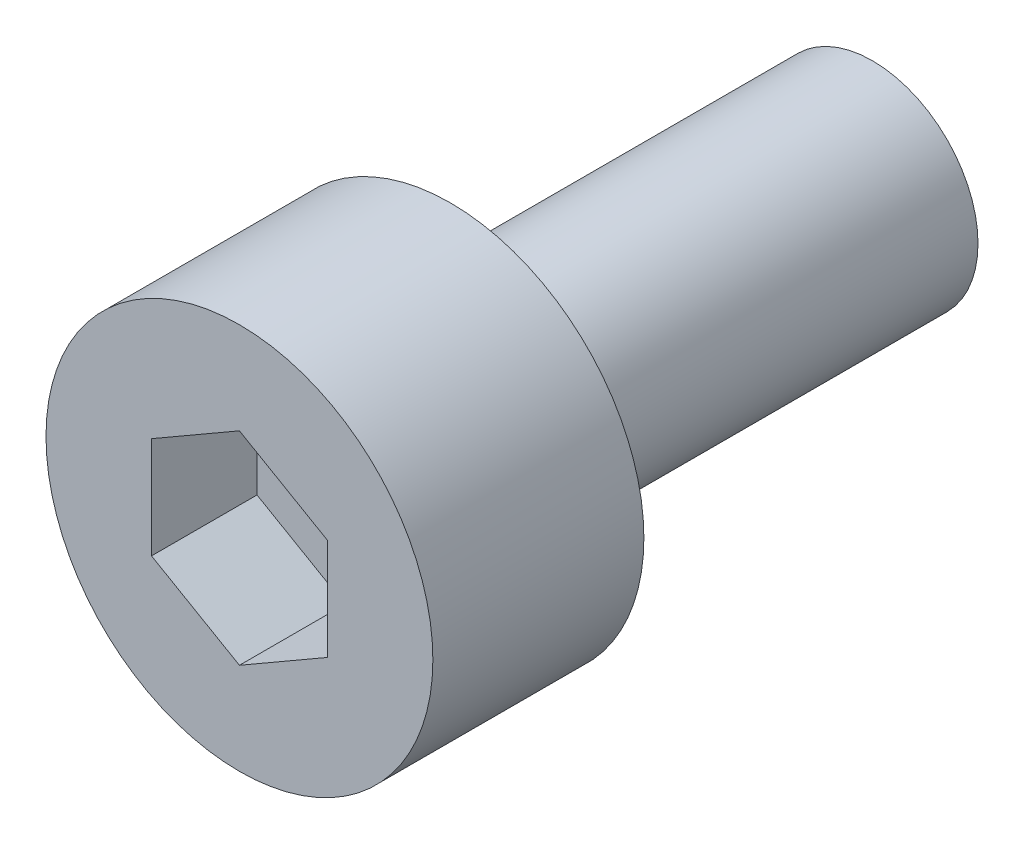
ISO-10303-21;
HEADER;
FILE_DESCRIPTION(('STEP AP214'),'2;1');
FILE_NAME('part.step','',(''),(''),'','','');
FILE_SCHEMA(('AUTOMOTIVE_DESIGN { 1 0 10303 214 1 1 1 1 }'));
ENDSEC;
DATA;
#1=APPLICATION_CONTEXT('core data for automotive mechanical design processes');
#2=APPLICATION_PROTOCOL_DEFINITION('international standard','automotive_design',2000,#1);
#3=PRODUCT_CONTEXT('',#1,'mechanical');
#4=PRODUCT('Part','Part','',(#3));
#5=PRODUCT_RELATED_PRODUCT_CATEGORY('part','',(#4));
#6=PRODUCT_DEFINITION_FORMATION('','',#4);
#7=PRODUCT_DEFINITION_CONTEXT('part definition',#1,'design');
#8=PRODUCT_DEFINITION('design','',#6,#7);
#9=PRODUCT_DEFINITION_SHAPE('','',#8);
#10=(LENGTH_UNIT() NAMED_UNIT(*) SI_UNIT(.MILLI.,.METRE.));
#11=(NAMED_UNIT(*) PLANE_ANGLE_UNIT() SI_UNIT($,.RADIAN.));
#12=(NAMED_UNIT(*) SI_UNIT($,.STERADIAN.) SOLID_ANGLE_UNIT());
#13=UNCERTAINTY_MEASURE_WITH_UNIT(LENGTH_MEASURE(1.E-05),#10,'distance_accuracy_value','');
#14=(GEOMETRIC_REPRESENTATION_CONTEXT(3) GLOBAL_UNCERTAINTY_ASSIGNED_CONTEXT((#13)) GLOBAL_UNIT_ASSIGNED_CONTEXT((#10,
#11,#12)) REPRESENTATION_CONTEXT('',''));
#15=CARTESIAN_POINT('',(0.,0.,0.));
#16=DIRECTION('',(0.,0.,1.));
#17=DIRECTION('',(1.,0.,0.));
#18=AXIS2_PLACEMENT_3D('',#15,#16,#17);
#19=CARTESIAN_POINT('',(0.,0.,3.));
#20=DIRECTION('',(0.,0.,-1.));
#21=DIRECTION('',(-1.,0.,0.));
#22=AXIS2_PLACEMENT_3D('',#19,#20,#21);
#23=CYLINDRICAL_SURFACE('',#22,2.75);
#24=CARTESIAN_POINT('',(0.,0.,3.));
#25=DIRECTION('',(0.,0.,1.));
#26=DIRECTION('',(1.,0.,0.));
#27=AXIS2_PLACEMENT_3D('',#24,#25,#26);
#28=CIRCLE('',#27,2.75);
#29=CARTESIAN_POINT('',(2.75,0.,3.));
#30=VERTEX_POINT('',#29);
#31=EDGE_CURVE('E52',#30,#30,#28,.T.);
#32=ORIENTED_EDGE('',*,*,#31,.F.);
#33=EDGE_LOOP('',(#32));
#34=FACE_BOUND('',#33,.T.);
#35=CARTESIAN_POINT('',(0.,0.,0.));
#36=DIRECTION('',(0.,0.,1.));
#37=DIRECTION('',(1.,0.,0.));
#38=AXIS2_PLACEMENT_3D('',#35,#36,#37);
#39=CIRCLE('',#38,2.75);
#40=CARTESIAN_POINT('',(2.75,0.,0.));
#41=VERTEX_POINT('',#40);
#42=EDGE_CURVE('E46',#41,#41,#39,.T.);
#43=ORIENTED_EDGE('',*,*,#42,.T.);
#44=EDGE_LOOP('',(#43));
#45=FACE_BOUND('',#44,.T.);
#46=ADVANCED_FACE('F43',(#34,#45),#23,.T.);
#47=CARTESIAN_POINT('',(0.,0.,3.));
#48=DIRECTION('',(0.,0.,1.));
#49=DIRECTION('',(1.,0.,0.));
#50=AXIS2_PLACEMENT_3D('',#47,#48,#49);
#51=PLANE('',#50);
#52=DIRECTION('',(0.866025403784439,-0.5,0.));
#53=VECTOR('',#52,1.);
#54=CARTESIAN_POINT('',(-1.25,-0.721687836487032,3.));
#55=LINE('',#54,#53);
#56=CARTESIAN_POINT('',(-1.25,-0.721687836487032,3.));
#57=VERTEX_POINT('',#56);
#58=CARTESIAN_POINT('',(0.,-1.44337567297406,3.));
#59=VERTEX_POINT('',#58);
#60=EDGE_CURVE('E60',#57,#59,#55,.T.);
#61=ORIENTED_EDGE('',*,*,#60,.F.);
#62=DIRECTION('',(0.,-1.,0.));
#63=VECTOR('',#62,1.);
#64=CARTESIAN_POINT('',(-1.25,0.721687836487032,3.));
#65=LINE('',#64,#63);
#66=CARTESIAN_POINT('',(-1.25,0.721687836487032,3.));
#67=VERTEX_POINT('',#66);
#68=EDGE_CURVE('E154',#67,#57,#65,.T.);
#69=ORIENTED_EDGE('',*,*,#68,.F.);
#70=DIRECTION('',(-0.866025403784438,-0.5,0.));
#71=VECTOR('',#70,1.);
#72=CARTESIAN_POINT('',(0.,1.44337567297407,3.));
#73=LINE('',#72,#71);
#74=CARTESIAN_POINT('',(0.,1.44337567297407,3.));
#75=VERTEX_POINT('',#74);
#76=EDGE_CURVE('E151',#75,#67,#73,.T.);
#77=ORIENTED_EDGE('',*,*,#76,.F.);
#78=DIRECTION('',(-0.866025403784439,0.5,0.));
#79=VECTOR('',#78,1.);
#80=CARTESIAN_POINT('',(1.25,0.721687836487033,3.));
#81=LINE('',#80,#79);
#82=CARTESIAN_POINT('',(1.25,0.721687836487033,3.));
#83=VERTEX_POINT('',#82);
#84=EDGE_CURVE('E108',#83,#75,#81,.T.);
#85=ORIENTED_EDGE('',*,*,#84,.F.);
#86=DIRECTION('',(0.,1.,0.));
#87=VECTOR('',#86,1.);
#88=CARTESIAN_POINT('',(1.25,-0.721687836487032,3.));
#89=LINE('',#88,#87);
#90=CARTESIAN_POINT('',(1.25,-0.721687836487032,3.));
#91=VERTEX_POINT('',#90);
#92=EDGE_CURVE('E145',#91,#83,#89,.T.);
#93=ORIENTED_EDGE('',*,*,#92,.F.);
#94=DIRECTION('',(0.866025403784439,0.5,0.));
#95=VECTOR('',#94,1.);
#96=CARTESIAN_POINT('',(0.,-1.44337567297406,3.));
#97=LINE('',#96,#95);
#98=EDGE_CURVE('E140',#59,#91,#97,.T.);
#99=ORIENTED_EDGE('',*,*,#98,.F.);
#100=EDGE_LOOP('',(#61,#69,#77,#85,#93,#99));
#101=FACE_BOUND('',#100,.T.);
#102=ORIENTED_EDGE('',*,*,#31,.T.);
#103=EDGE_LOOP('',(#102));
#104=FACE_BOUND('',#103,.T.);
#105=ADVANCED_FACE('F180',(#101,#104),#51,.T.);
#106=CARTESIAN_POINT('',(0.,0.,0.));
#107=DIRECTION('',(0.,0.,1.));
#108=DIRECTION('',(1.,0.,0.));
#109=AXIS2_PLACEMENT_3D('',#106,#107,#108);
#110=PLANE('',#109);
#111=CARTESIAN_POINT('',(0.,0.,0.));
#112=DIRECTION('',(0.,0.,-1.));
#113=DIRECTION('',(-1.,0.,0.));
#114=AXIS2_PLACEMENT_3D('',#111,#112,#113);
#115=CIRCLE('',#114,1.5);
#116=CARTESIAN_POINT('',(-1.5,0.,0.));
#117=VERTEX_POINT('',#116);
#118=EDGE_CURVE('E11',#117,#117,#115,.T.);
#119=ORIENTED_EDGE('',*,*,#118,.F.);
#120=EDGE_LOOP('',(#119));
#121=FACE_BOUND('',#120,.T.);
#122=ORIENTED_EDGE('',*,*,#42,.F.);
#123=EDGE_LOOP('',(#122));
#124=FACE_BOUND('',#123,.T.);
#125=ADVANCED_FACE('F177',(#121,#124),#110,.F.);
#126=CARTESIAN_POINT('',(-1.25,-0.721687836487032,1.5));
#127=DIRECTION('',(-0.5,-0.866025403784439,0.));
#128=DIRECTION('',(0.866025403784439,-0.5,0.));
#129=AXIS2_PLACEMENT_3D('',#126,#127,#128);
#130=PLANE('',#129);
#131=ORIENTED_EDGE('',*,*,#60,.T.);
#132=DIRECTION('',(0.,0.,1.));
#133=VECTOR('',#132,1.);
#134=CARTESIAN_POINT('',(0.,-1.44337567297406,1.5));
#135=LINE('',#134,#133);
#136=CARTESIAN_POINT('',(0.,-1.44337567297406,1.5));
#137=VERTEX_POINT('',#136);
#138=EDGE_CURVE('E90',#137,#59,#135,.T.);
#139=ORIENTED_EDGE('',*,*,#138,.F.);
#140=DIRECTION('',(0.866025403784439,-0.5,0.));
#141=VECTOR('',#140,1.);
#142=CARTESIAN_POINT('',(-1.25,-0.721687836487032,1.5));
#143=LINE('',#142,#141);
#144=CARTESIAN_POINT('',(-1.25,-0.721687836487032,1.5));
#145=VERTEX_POINT('',#144);
#146=EDGE_CURVE('E157',#145,#137,#143,.T.);
#147=ORIENTED_EDGE('',*,*,#146,.F.);
#148=DIRECTION('',(0.,0.,1.));
#149=VECTOR('',#148,1.);
#150=CARTESIAN_POINT('',(-1.25,-0.721687836487032,1.5));
#151=LINE('',#150,#149);
#152=EDGE_CURVE('E68',#145,#57,#151,.T.);
#153=ORIENTED_EDGE('',*,*,#152,.T.);
#154=EDGE_LOOP('',(#131,#139,#147,#153));
#155=FACE_BOUND('',#154,.T.);
#156=ADVANCED_FACE('F179',(#155),#130,.F.);
#157=CARTESIAN_POINT('',(-1.25,0.721687836487032,1.5));
#158=DIRECTION('',(-1.,0.,0.));
#159=DIRECTION('',(0.,0.,1.));
#160=AXIS2_PLACEMENT_3D('',#157,#158,#159);
#161=PLANE('',#160);
#162=ORIENTED_EDGE('',*,*,#68,.T.);
#163=ORIENTED_EDGE('',*,*,#152,.F.);
#164=DIRECTION('',(0.,-1.,0.));
#165=VECTOR('',#164,1.);
#166=CARTESIAN_POINT('',(-1.25,0.721687836487032,1.5));
#167=LINE('',#166,#165);
#168=CARTESIAN_POINT('',(-1.25,0.721687836487032,1.5));
#169=VERTEX_POINT('',#168);
#170=EDGE_CURVE('E122',#169,#145,#167,.T.);
#171=ORIENTED_EDGE('',*,*,#170,.F.);
#172=DIRECTION('',(0.,0.,1.));
#173=VECTOR('',#172,1.);
#174=CARTESIAN_POINT('',(-1.25,0.721687836487032,1.5));
#175=LINE('',#174,#173);
#176=EDGE_CURVE('E113',#169,#67,#175,.T.);
#177=ORIENTED_EDGE('',*,*,#176,.T.);
#178=EDGE_LOOP('',(#162,#163,#171,#177));
#179=FACE_BOUND('',#178,.T.);
#180=ADVANCED_FACE('F186',(#179),#161,.F.);
#181=CARTESIAN_POINT('',(0.,1.44337567297407,1.5));
#182=DIRECTION('',(-0.5,0.866025403784439,0.));
#183=DIRECTION('',(-0.866025403784439,-0.5,0.));
#184=AXIS2_PLACEMENT_3D('',#181,#182,#183);
#185=PLANE('',#184);
#186=ORIENTED_EDGE('',*,*,#76,.T.);
#187=ORIENTED_EDGE('',*,*,#176,.F.);
#188=DIRECTION('',(-0.866025403784438,-0.5,0.));
#189=VECTOR('',#188,1.);
#190=CARTESIAN_POINT('',(0.,1.44337567297407,1.5));
#191=LINE('',#190,#189);
#192=CARTESIAN_POINT('',(0.,1.44337567297407,1.5));
#193=VERTEX_POINT('',#192);
#194=EDGE_CURVE('E117',#193,#169,#191,.T.);
#195=ORIENTED_EDGE('',*,*,#194,.F.);
#196=DIRECTION('',(0.,0.,1.));
#197=VECTOR('',#196,1.);
#198=CARTESIAN_POINT('',(0.,1.44337567297407,1.5));
#199=LINE('',#198,#197);
#200=EDGE_CURVE('E101',#193,#75,#199,.T.);
#201=ORIENTED_EDGE('',*,*,#200,.T.);
#202=EDGE_LOOP('',(#186,#187,#195,#201));
#203=FACE_BOUND('',#202,.T.);
#204=ADVANCED_FACE('F118',(#203),#185,.F.);
#205=CARTESIAN_POINT('',(1.25,0.721687836487033,1.5));
#206=DIRECTION('',(0.5,0.866025403784439,0.));
#207=DIRECTION('',(-0.866025403784439,0.5,0.));
#208=AXIS2_PLACEMENT_3D('',#205,#206,#207);
#209=PLANE('',#208);
#210=ORIENTED_EDGE('',*,*,#84,.T.);
#211=ORIENTED_EDGE('',*,*,#200,.F.);
#212=DIRECTION('',(-0.866025403784439,0.5,0.));
#213=VECTOR('',#212,1.);
#214=CARTESIAN_POINT('',(1.25,0.721687836487033,1.5));
#215=LINE('',#214,#213);
#216=CARTESIAN_POINT('',(1.25,0.721687836487033,1.5));
#217=VERTEX_POINT('',#216);
#218=EDGE_CURVE('E105',#217,#193,#215,.T.);
#219=ORIENTED_EDGE('',*,*,#218,.F.);
#220=DIRECTION('',(0.,0.,1.));
#221=VECTOR('',#220,1.);
#222=CARTESIAN_POINT('',(1.25,0.721687836487033,1.5));
#223=LINE('',#222,#221);
#224=EDGE_CURVE('E114',#217,#83,#223,.T.);
#225=ORIENTED_EDGE('',*,*,#224,.T.);
#226=EDGE_LOOP('',(#210,#211,#219,#225));
#227=FACE_BOUND('',#226,.T.);
#228=ADVANCED_FACE('F103',(#227),#209,.F.);
#229=CARTESIAN_POINT('',(1.25,-0.721687836487032,1.5));
#230=DIRECTION('',(1.,0.,0.));
#231=DIRECTION('',(0.,1.,0.));
#232=AXIS2_PLACEMENT_3D('',#229,#230,#231);
#233=PLANE('',#232);
#234=ORIENTED_EDGE('',*,*,#92,.T.);
#235=ORIENTED_EDGE('',*,*,#224,.F.);
#236=DIRECTION('',(0.,1.,0.));
#237=VECTOR('',#236,1.);
#238=CARTESIAN_POINT('',(1.25,-0.721687836487032,1.5));
#239=LINE('',#238,#237);
#240=CARTESIAN_POINT('',(1.25,-0.721687836487032,1.5));
#241=VERTEX_POINT('',#240);
#242=EDGE_CURVE('E128',#241,#217,#239,.T.);
#243=ORIENTED_EDGE('',*,*,#242,.F.);
#244=DIRECTION('',(0.,0.,1.));
#245=VECTOR('',#244,1.);
#246=CARTESIAN_POINT('',(1.25,-0.721687836487032,1.5));
#247=LINE('',#246,#245);
#248=EDGE_CURVE('E164',#241,#91,#247,.T.);
#249=ORIENTED_EDGE('',*,*,#248,.T.);
#250=EDGE_LOOP('',(#234,#235,#243,#249));
#251=FACE_BOUND('',#250,.T.);
#252=ADVANCED_FACE('F235',(#251),#233,.F.);
#253=CARTESIAN_POINT('',(0.,-1.44337567297406,1.5));
#254=DIRECTION('',(0.5,-0.866025403784438,0.));
#255=DIRECTION('',(0.866025403784439,0.5,0.));
#256=AXIS2_PLACEMENT_3D('',#253,#254,#255);
#257=PLANE('',#256);
#258=ORIENTED_EDGE('',*,*,#98,.T.);
#259=ORIENTED_EDGE('',*,*,#248,.F.);
#260=DIRECTION('',(0.866025403784439,0.5,0.));
#261=VECTOR('',#260,1.);
#262=CARTESIAN_POINT('',(0.,-1.44337567297406,1.5));
#263=LINE('',#262,#261);
#264=EDGE_CURVE('E132',#137,#241,#263,.T.);
#265=ORIENTED_EDGE('',*,*,#264,.F.);
#266=ORIENTED_EDGE('',*,*,#138,.T.);
#267=EDGE_LOOP('',(#258,#259,#265,#266));
#268=FACE_BOUND('',#267,.T.);
#269=ADVANCED_FACE('F245',(#268),#257,.F.);
#270=CARTESIAN_POINT('',(0.,0.,1.5));
#271=DIRECTION('',(0.,0.,1.));
#272=DIRECTION('',(1.,0.,0.));
#273=AXIS2_PLACEMENT_3D('',#270,#271,#272);
#274=PLANE('',#273);
#275=ORIENTED_EDGE('',*,*,#146,.T.);
#276=ORIENTED_EDGE('',*,*,#264,.T.);
#277=ORIENTED_EDGE('',*,*,#242,.T.);
#278=ORIENTED_EDGE('',*,*,#218,.T.);
#279=ORIENTED_EDGE('',*,*,#194,.T.);
#280=ORIENTED_EDGE('',*,*,#170,.T.);
#281=EDGE_LOOP('',(#275,#276,#277,#278,#279,#280));
#282=FACE_BOUND('',#281,.T.);
#283=ADVANCED_FACE('F125',(#282),#274,.T.);
#284=CARTESIAN_POINT('',(0.,0.,-6.));
#285=DIRECTION('',(0.,0.,1.));
#286=DIRECTION('',(1.,0.,0.));
#287=AXIS2_PLACEMENT_3D('',#284,#285,#286);
#288=CYLINDRICAL_SURFACE('',#287,1.5);
#289=CARTESIAN_POINT('',(0.,0.,-6.));
#290=DIRECTION('',(0.,0.,-1.));
#291=DIRECTION('',(-1.,0.,0.));
#292=AXIS2_PLACEMENT_3D('',#289,#290,#291);
#293=CIRCLE('',#292,1.5);
#294=CARTESIAN_POINT('',(-1.5,0.,-6.));
#295=VERTEX_POINT('',#294);
#296=EDGE_CURVE('E141',#295,#295,#293,.T.);
#297=ORIENTED_EDGE('',*,*,#296,.F.);
#298=EDGE_LOOP('',(#297));
#299=FACE_BOUND('',#298,.T.);
#300=ORIENTED_EDGE('',*,*,#118,.T.);
#301=EDGE_LOOP('',(#300));
#302=FACE_BOUND('',#301,.T.);
#303=ADVANCED_FACE('F265',(#299,#302),#288,.T.);
#304=CARTESIAN_POINT('',(0.,0.,-6.));
#305=DIRECTION('',(0.,0.,-1.));
#306=DIRECTION('',(-1.,0.,0.));
#307=AXIS2_PLACEMENT_3D('',#304,#305,#306);
#308=PLANE('',#307);
#309=ORIENTED_EDGE('',*,*,#296,.T.);
#310=EDGE_LOOP('',(#309));
#311=FACE_BOUND('',#310,.T.);
#312=ADVANCED_FACE('F280',(#311),#308,.T.);
#313=CLOSED_SHELL('',(#46,#105,#125,#156,#180,#204,#228,#252,#269,#283,#303,#312));
#314=MANIFOLD_SOLID_BREP('B2',#313);
#315=ADVANCED_BREP_SHAPE_REPRESENTATION('',(#18,#314),#14);
#316=SHAPE_DEFINITION_REPRESENTATION(#9,#315);
ENDSEC;
END-ISO-10303-21;
